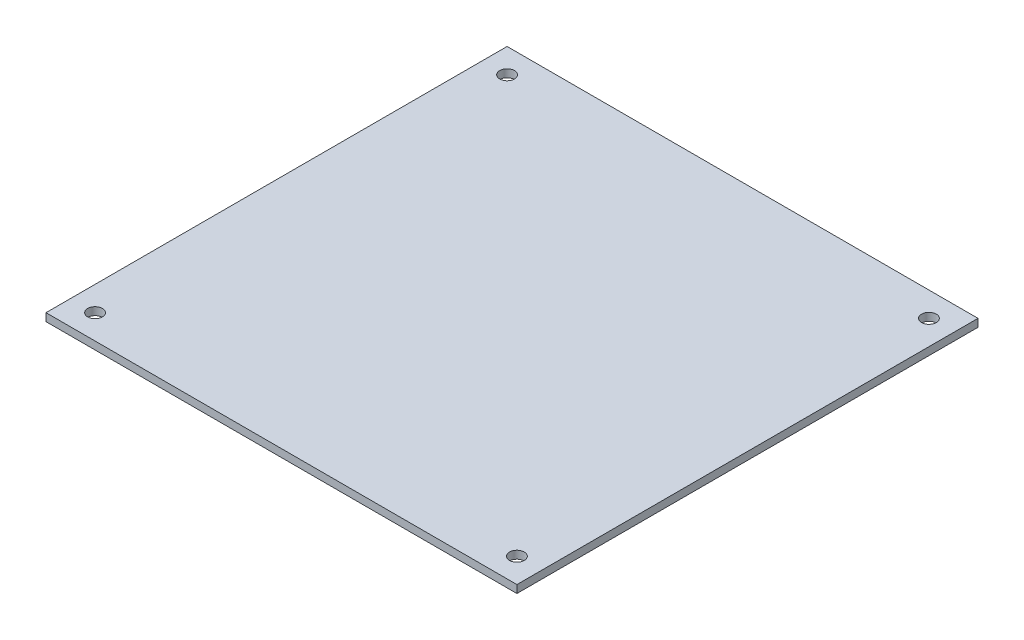
ISO-10303-21;
HEADER;
FILE_DESCRIPTION(('STEP AP214'),'2;1');
FILE_NAME('part.step','',(''),(''),'','','');
FILE_SCHEMA(('AUTOMOTIVE_DESIGN { 1 0 10303 214 1 1 1 1 }'));
ENDSEC;
DATA;
#1=APPLICATION_CONTEXT('core data for automotive mechanical design processes');
#2=APPLICATION_PROTOCOL_DEFINITION('international standard','automotive_design',2000,#1);
#3=PRODUCT_CONTEXT('',#1,'mechanical');
#4=PRODUCT('Part','Part','',(#3));
#5=PRODUCT_RELATED_PRODUCT_CATEGORY('part','',(#4));
#6=PRODUCT_DEFINITION_FORMATION('','',#4);
#7=PRODUCT_DEFINITION_CONTEXT('part definition',#1,'design');
#8=PRODUCT_DEFINITION('design','',#6,#7);
#9=PRODUCT_DEFINITION_SHAPE('','',#8);
#10=(LENGTH_UNIT() NAMED_UNIT(*) SI_UNIT(.MILLI.,.METRE.));
#11=(NAMED_UNIT(*) PLANE_ANGLE_UNIT() SI_UNIT($,.RADIAN.));
#12=(NAMED_UNIT(*) SI_UNIT($,.STERADIAN.) SOLID_ANGLE_UNIT());
#13=UNCERTAINTY_MEASURE_WITH_UNIT(LENGTH_MEASURE(1.E-05),#10,'distance_accuracy_value','');
#14=(GEOMETRIC_REPRESENTATION_CONTEXT(3) GLOBAL_UNCERTAINTY_ASSIGNED_CONTEXT((#13)) GLOBAL_UNIT_ASSIGNED_CONTEXT((#10,
#11,#12)) REPRESENTATION_CONTEXT('',''));
#15=CARTESIAN_POINT('',(0.,0.,0.));
#16=DIRECTION('',(0.,0.,1.));
#17=DIRECTION('',(1.,0.,0.));
#18=AXIS2_PLACEMENT_3D('',#15,#16,#17);
#19=CARTESIAN_POINT('',(-48.,1.5875,47.));
#20=DIRECTION('',(0.,0.,-1.));
#21=DIRECTION('',(-1.,0.,0.));
#22=AXIS2_PLACEMENT_3D('',#19,#20,#21);
#23=PLANE('',#22);
#24=DIRECTION('',(1.,0.,0.));
#25=VECTOR('',#24,1.);
#26=CARTESIAN_POINT('',(-48.,0.,47.));
#27=LINE('',#26,#25);
#28=CARTESIAN_POINT('',(-48.,0.,47.));
#29=VERTEX_POINT('',#28);
#30=CARTESIAN_POINT('',(48.,0.,47.));
#31=VERTEX_POINT('',#30);
#32=EDGE_CURVE('E102',#29,#31,#27,.T.);
#33=ORIENTED_EDGE('',*,*,#32,.T.);
#34=DIRECTION('',(0.,-1.,0.));
#35=VECTOR('',#34,1.);
#36=CARTESIAN_POINT('',(48.,1.5875,47.));
#37=LINE('',#36,#35);
#38=CARTESIAN_POINT('',(48.,1.5875,47.));
#39=VERTEX_POINT('',#38);
#40=EDGE_CURVE('E11',#39,#31,#37,.T.);
#41=ORIENTED_EDGE('',*,*,#40,.F.);
#42=DIRECTION('',(1.,0.,0.));
#43=VECTOR('',#42,1.);
#44=CARTESIAN_POINT('',(-48.,1.5875,47.));
#45=LINE('',#44,#43);
#46=CARTESIAN_POINT('',(-48.,1.5875,47.));
#47=VERTEX_POINT('',#46);
#48=EDGE_CURVE('E88',#47,#39,#45,.T.);
#49=ORIENTED_EDGE('',*,*,#48,.F.);
#50=DIRECTION('',(0.,-1.,0.));
#51=VECTOR('',#50,1.);
#52=CARTESIAN_POINT('',(-48.,1.5875,47.));
#53=LINE('',#52,#51);
#54=EDGE_CURVE('E55',#47,#29,#53,.T.);
#55=ORIENTED_EDGE('',*,*,#54,.T.);
#56=EDGE_LOOP('',(#33,#41,#49,#55));
#57=FACE_BOUND('',#56,.T.);
#58=ADVANCED_FACE('F39',(#57),#23,.F.);
#59=CARTESIAN_POINT('',(48.,1.5875,47.));
#60=DIRECTION('',(-1.,0.,0.));
#61=DIRECTION('',(0.,0.,1.));
#62=AXIS2_PLACEMENT_3D('',#59,#60,#61);
#63=PLANE('',#62);
#64=DIRECTION('',(0.,0.,-1.));
#65=VECTOR('',#64,1.);
#66=CARTESIAN_POINT('',(48.,0.,47.));
#67=LINE('',#66,#65);
#68=CARTESIAN_POINT('',(48.,0.,-47.));
#69=VERTEX_POINT('',#68);
#70=EDGE_CURVE('E93',#31,#69,#67,.T.);
#71=ORIENTED_EDGE('',*,*,#70,.T.);
#72=DIRECTION('',(0.,-1.,0.));
#73=VECTOR('',#72,1.);
#74=CARTESIAN_POINT('',(48.,1.5875,-47.));
#75=LINE('',#74,#73);
#76=CARTESIAN_POINT('',(48.,1.5875,-47.));
#77=VERTEX_POINT('',#76);
#78=EDGE_CURVE('E47',#77,#69,#75,.T.);
#79=ORIENTED_EDGE('',*,*,#78,.F.);
#80=DIRECTION('',(0.,0.,-1.));
#81=VECTOR('',#80,1.);
#82=CARTESIAN_POINT('',(48.,1.5875,47.));
#83=LINE('',#82,#81);
#84=EDGE_CURVE('E80',#39,#77,#83,.T.);
#85=ORIENTED_EDGE('',*,*,#84,.F.);
#86=ORIENTED_EDGE('',*,*,#40,.T.);
#87=EDGE_LOOP('',(#71,#79,#85,#86));
#88=FACE_BOUND('',#87,.T.);
#89=ADVANCED_FACE('F92',(#88),#63,.F.);
#90=CARTESIAN_POINT('',(-48.,1.5875,-47.));
#91=DIRECTION('',(0.,0.,-1.));
#92=DIRECTION('',(-1.,0.,0.));
#93=AXIS2_PLACEMENT_3D('',#90,#91,#92);
#94=PLANE('',#93);
#95=DIRECTION('',(1.,0.,0.));
#96=VECTOR('',#95,1.);
#97=CARTESIAN_POINT('',(-48.,0.,-47.));
#98=LINE('',#97,#96);
#99=CARTESIAN_POINT('',(-48.,0.,-47.));
#100=VERTEX_POINT('',#99);
#101=EDGE_CURVE('E106',#100,#69,#98,.T.);
#102=ORIENTED_EDGE('',*,*,#101,.F.);
#103=DIRECTION('',(0.,-1.,0.));
#104=VECTOR('',#103,1.);
#105=CARTESIAN_POINT('',(-48.,1.5875,-47.));
#106=LINE('',#105,#104);
#107=CARTESIAN_POINT('',(-48.,1.5875,-47.));
#108=VERTEX_POINT('',#107);
#109=EDGE_CURVE('E69',#108,#100,#106,.T.);
#110=ORIENTED_EDGE('',*,*,#109,.F.);
#111=DIRECTION('',(1.,0.,0.));
#112=VECTOR('',#111,1.);
#113=CARTESIAN_POINT('',(-48.,1.5875,-47.));
#114=LINE('',#113,#112);
#115=EDGE_CURVE('E87',#108,#77,#114,.T.);
#116=ORIENTED_EDGE('',*,*,#115,.T.);
#117=ORIENTED_EDGE('',*,*,#78,.T.);
#118=EDGE_LOOP('',(#102,#110,#116,#117));
#119=FACE_BOUND('',#118,.T.);
#120=ADVANCED_FACE('F96',(#119),#94,.T.);
#121=CARTESIAN_POINT('',(-48.,1.5875,47.));
#122=DIRECTION('',(-1.,0.,0.));
#123=DIRECTION('',(0.,0.,1.));
#124=AXIS2_PLACEMENT_3D('',#121,#122,#123);
#125=PLANE('',#124);
#126=DIRECTION('',(0.,0.,-1.));
#127=VECTOR('',#126,1.);
#128=CARTESIAN_POINT('',(-48.,0.,47.));
#129=LINE('',#128,#127);
#130=EDGE_CURVE('E108',#29,#100,#129,.T.);
#131=ORIENTED_EDGE('',*,*,#130,.F.);
#132=ORIENTED_EDGE('',*,*,#54,.F.);
#133=DIRECTION('',(0.,0.,-1.));
#134=VECTOR('',#133,1.);
#135=CARTESIAN_POINT('',(-48.,1.5875,47.));
#136=LINE('',#135,#134);
#137=EDGE_CURVE('E97',#47,#108,#136,.T.);
#138=ORIENTED_EDGE('',*,*,#137,.T.);
#139=ORIENTED_EDGE('',*,*,#109,.T.);
#140=EDGE_LOOP('',(#131,#132,#138,#139));
#141=FACE_BOUND('',#140,.T.);
#142=ADVANCED_FACE('F150',(#141),#125,.T.);
#143=CARTESIAN_POINT('',(0.,1.5875,0.));
#144=DIRECTION('',(0.,1.,0.));
#145=DIRECTION('',(0.,0.,1.));
#146=AXIS2_PLACEMENT_3D('',#143,#144,#145);
#147=PLANE('',#146);
#148=CARTESIAN_POINT('',(-43.,1.5875,42.));
#149=DIRECTION('',(0.,1.,0.));
#150=DIRECTION('',(0.,0.,1.));
#151=AXIS2_PLACEMENT_3D('',#148,#149,#150);
#152=CIRCLE('',#151,1.5);
#153=CARTESIAN_POINT('',(-43.,1.5875,43.5));
#154=VERTEX_POINT('',#153);
#155=EDGE_CURVE('E132',#154,#154,#152,.T.);
#156=ORIENTED_EDGE('',*,*,#155,.F.);
#157=EDGE_LOOP('',(#156));
#158=FACE_BOUND('',#157,.T.);
#159=CARTESIAN_POINT('',(43.,1.5875,42.));
#160=DIRECTION('',(0.,1.,0.));
#161=DIRECTION('',(0.,0.,1.));
#162=AXIS2_PLACEMENT_3D('',#159,#160,#161);
#163=CIRCLE('',#162,1.5);
#164=CARTESIAN_POINT('',(43.,1.5875,43.5));
#165=VERTEX_POINT('',#164);
#166=EDGE_CURVE('E126',#165,#165,#163,.T.);
#167=ORIENTED_EDGE('',*,*,#166,.F.);
#168=EDGE_LOOP('',(#167));
#169=FACE_BOUND('',#168,.T.);
#170=CARTESIAN_POINT('',(43.,1.5875,-42.));
#171=DIRECTION('',(0.,1.,0.));
#172=DIRECTION('',(0.,0.,1.));
#173=AXIS2_PLACEMENT_3D('',#170,#171,#172);
#174=CIRCLE('',#173,1.5);
#175=CARTESIAN_POINT('',(43.,1.5875,-40.5));
#176=VERTEX_POINT('',#175);
#177=EDGE_CURVE('E120',#176,#176,#174,.T.);
#178=ORIENTED_EDGE('',*,*,#177,.F.);
#179=EDGE_LOOP('',(#178));
#180=FACE_BOUND('',#179,.T.);
#181=CARTESIAN_POINT('',(-43.,1.5875,-42.));
#182=DIRECTION('',(0.,1.,0.));
#183=DIRECTION('',(0.,0.,1.));
#184=AXIS2_PLACEMENT_3D('',#181,#182,#183);
#185=CIRCLE('',#184,1.5);
#186=CARTESIAN_POINT('',(-43.,1.5875,-40.5));
#187=VERTEX_POINT('',#186);
#188=EDGE_CURVE('E114',#187,#187,#185,.T.);
#189=ORIENTED_EDGE('',*,*,#188,.F.);
#190=EDGE_LOOP('',(#189));
#191=FACE_BOUND('',#190,.T.);
#192=ORIENTED_EDGE('',*,*,#48,.T.);
#193=ORIENTED_EDGE('',*,*,#84,.T.);
#194=ORIENTED_EDGE('',*,*,#115,.F.);
#195=ORIENTED_EDGE('',*,*,#137,.F.);
#196=EDGE_LOOP('',(#192,#193,#194,#195));
#197=FACE_BOUND('',#196,.T.);
#198=ADVANCED_FACE('F84',(#158,#169,#180,#191,#197),#147,.T.);
#199=CARTESIAN_POINT('',(0.,0.,0.));
#200=DIRECTION('',(0.,1.,0.));
#201=DIRECTION('',(0.,0.,1.));
#202=AXIS2_PLACEMENT_3D('',#199,#200,#201);
#203=PLANE('',#202);
#204=CARTESIAN_POINT('',(-43.,0.,42.));
#205=DIRECTION('',(0.,1.,0.));
#206=DIRECTION('',(0.,0.,1.));
#207=AXIS2_PLACEMENT_3D('',#204,#205,#206);
#208=CIRCLE('',#207,1.5);
#209=CARTESIAN_POINT('',(-43.,0.,43.5));
#210=VERTEX_POINT('',#209);
#211=EDGE_CURVE('E129',#210,#210,#208,.T.);
#212=ORIENTED_EDGE('',*,*,#211,.T.);
#213=EDGE_LOOP('',(#212));
#214=FACE_BOUND('',#213,.T.);
#215=CARTESIAN_POINT('',(43.,0.,42.));
#216=DIRECTION('',(0.,1.,0.));
#217=DIRECTION('',(0.,0.,1.));
#218=AXIS2_PLACEMENT_3D('',#215,#216,#217);
#219=CIRCLE('',#218,1.5);
#220=CARTESIAN_POINT('',(43.,0.,43.5));
#221=VERTEX_POINT('',#220);
#222=EDGE_CURVE('E123',#221,#221,#219,.T.);
#223=ORIENTED_EDGE('',*,*,#222,.T.);
#224=EDGE_LOOP('',(#223));
#225=FACE_BOUND('',#224,.T.);
#226=CARTESIAN_POINT('',(43.,0.,-42.));
#227=DIRECTION('',(0.,1.,0.));
#228=DIRECTION('',(0.,0.,1.));
#229=AXIS2_PLACEMENT_3D('',#226,#227,#228);
#230=CIRCLE('',#229,1.5);
#231=CARTESIAN_POINT('',(43.,0.,-40.5));
#232=VERTEX_POINT('',#231);
#233=EDGE_CURVE('E117',#232,#232,#230,.T.);
#234=ORIENTED_EDGE('',*,*,#233,.T.);
#235=EDGE_LOOP('',(#234));
#236=FACE_BOUND('',#235,.T.);
#237=CARTESIAN_POINT('',(-43.,0.,-42.));
#238=DIRECTION('',(0.,1.,0.));
#239=DIRECTION('',(0.,0.,1.));
#240=AXIS2_PLACEMENT_3D('',#237,#238,#239);
#241=CIRCLE('',#240,1.5);
#242=CARTESIAN_POINT('',(-43.,0.,-40.5));
#243=VERTEX_POINT('',#242);
#244=EDGE_CURVE('E104',#243,#243,#241,.T.);
#245=ORIENTED_EDGE('',*,*,#244,.T.);
#246=EDGE_LOOP('',(#245));
#247=FACE_BOUND('',#246,.T.);
#248=ORIENTED_EDGE('',*,*,#32,.F.);
#249=ORIENTED_EDGE('',*,*,#130,.T.);
#250=ORIENTED_EDGE('',*,*,#101,.T.);
#251=ORIENTED_EDGE('',*,*,#70,.F.);
#252=EDGE_LOOP('',(#248,#249,#250,#251));
#253=FACE_BOUND('',#252,.T.);
#254=ADVANCED_FACE('F138',(#214,#225,#236,#247,#253),#203,.F.);
#255=CARTESIAN_POINT('',(-43.,0.,-42.));
#256=DIRECTION('',(0.,1.,0.));
#257=DIRECTION('',(0.,0.,1.));
#258=AXIS2_PLACEMENT_3D('',#255,#256,#257);
#259=CYLINDRICAL_SURFACE('',#258,1.5);
#260=ORIENTED_EDGE('',*,*,#244,.F.);
#261=EDGE_LOOP('',(#260));
#262=FACE_BOUND('',#261,.T.);
#263=ORIENTED_EDGE('',*,*,#188,.T.);
#264=EDGE_LOOP('',(#263));
#265=FACE_BOUND('',#264,.T.);
#266=ADVANCED_FACE('F158',(#262,#265),#259,.F.);
#267=CARTESIAN_POINT('',(43.,0.,-42.));
#268=DIRECTION('',(0.,1.,0.));
#269=DIRECTION('',(0.,0.,1.));
#270=AXIS2_PLACEMENT_3D('',#267,#268,#269);
#271=CYLINDRICAL_SURFACE('',#270,1.5);
#272=ORIENTED_EDGE('',*,*,#233,.F.);
#273=EDGE_LOOP('',(#272));
#274=FACE_BOUND('',#273,.T.);
#275=ORIENTED_EDGE('',*,*,#177,.T.);
#276=EDGE_LOOP('',(#275));
#277=FACE_BOUND('',#276,.T.);
#278=ADVANCED_FACE('F160',(#274,#277),#271,.F.);
#279=CARTESIAN_POINT('',(43.,0.,42.));
#280=DIRECTION('',(0.,1.,0.));
#281=DIRECTION('',(0.,0.,1.));
#282=AXIS2_PLACEMENT_3D('',#279,#280,#281);
#283=CYLINDRICAL_SURFACE('',#282,1.5);
#284=ORIENTED_EDGE('',*,*,#222,.F.);
#285=EDGE_LOOP('',(#284));
#286=FACE_BOUND('',#285,.T.);
#287=ORIENTED_EDGE('',*,*,#166,.T.);
#288=EDGE_LOOP('',(#287));
#289=FACE_BOUND('',#288,.T.);
#290=ADVANCED_FACE('F144',(#286,#289),#283,.F.);
#291=CARTESIAN_POINT('',(-43.,0.,42.));
#292=DIRECTION('',(0.,1.,0.));
#293=DIRECTION('',(0.,0.,1.));
#294=AXIS2_PLACEMENT_3D('',#291,#292,#293);
#295=CYLINDRICAL_SURFACE('',#294,1.5);
#296=ORIENTED_EDGE('',*,*,#211,.F.);
#297=EDGE_LOOP('',(#296));
#298=FACE_BOUND('',#297,.T.);
#299=ORIENTED_EDGE('',*,*,#155,.T.);
#300=EDGE_LOOP('',(#299));
#301=FACE_BOUND('',#300,.T.);
#302=ADVANCED_FACE('F141',(#298,#301),#295,.F.);
#303=CLOSED_SHELL('',(#58,#89,#120,#142,#198,#254,#266,#278,#290,#302));
#304=MANIFOLD_SOLID_BREP('B2',#303);
#305=ADVANCED_BREP_SHAPE_REPRESENTATION('',(#18,#304),#14);
#306=SHAPE_DEFINITION_REPRESENTATION(#9,#305);
ENDSEC;
END-ISO-10303-21;
